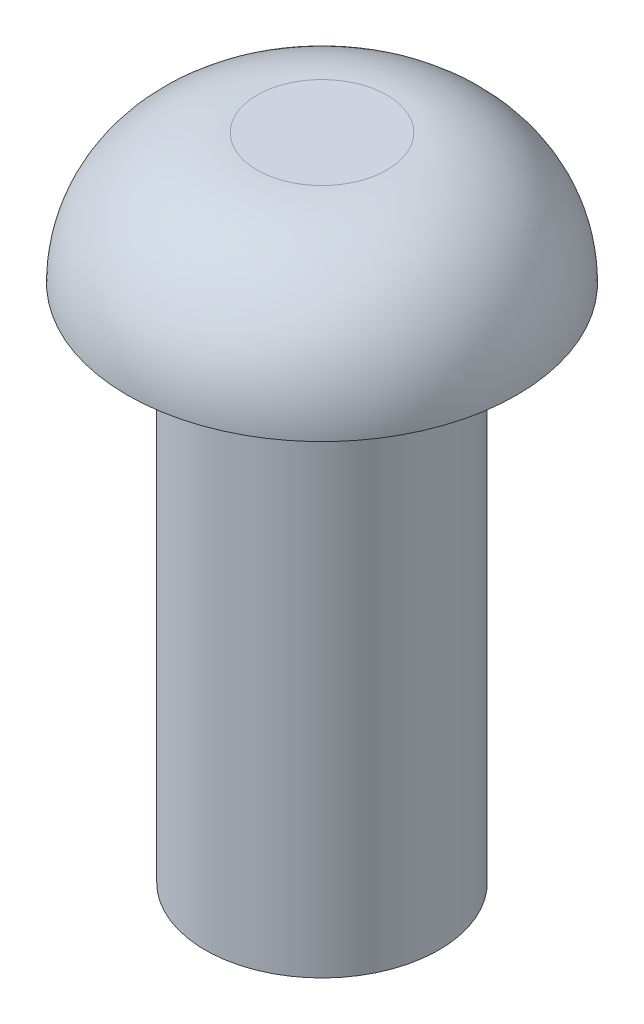
ISO-10303-21;
HEADER;
FILE_DESCRIPTION(('STEP AP214'),'2;1');
FILE_NAME('part.step','',(''),(''),'','','');
FILE_SCHEMA(('AUTOMOTIVE_DESIGN { 1 0 10303 214 1 1 1 1 }'));
ENDSEC;
DATA;
#1=APPLICATION_CONTEXT('core data for automotive mechanical design processes');
#2=APPLICATION_PROTOCOL_DEFINITION('international standard','automotive_design',2000,#1);
#3=PRODUCT_CONTEXT('',#1,'mechanical');
#4=PRODUCT('Part','Part','',(#3));
#5=PRODUCT_RELATED_PRODUCT_CATEGORY('part','',(#4));
#6=PRODUCT_DEFINITION_FORMATION('','',#4);
#7=PRODUCT_DEFINITION_CONTEXT('part definition',#1,'design');
#8=PRODUCT_DEFINITION('design','',#6,#7);
#9=PRODUCT_DEFINITION_SHAPE('','',#8);
#10=(LENGTH_UNIT() NAMED_UNIT(*) SI_UNIT(.MILLI.,.METRE.));
#11=(NAMED_UNIT(*) PLANE_ANGLE_UNIT() SI_UNIT($,.RADIAN.));
#12=(NAMED_UNIT(*) SI_UNIT($,.STERADIAN.) SOLID_ANGLE_UNIT());
#13=UNCERTAINTY_MEASURE_WITH_UNIT(LENGTH_MEASURE(1.E-05),#10,'distance_accuracy_value','');
#14=(GEOMETRIC_REPRESENTATION_CONTEXT(3) GLOBAL_UNCERTAINTY_ASSIGNED_CONTEXT((#13)) GLOBAL_UNIT_ASSIGNED_CONTEXT((#10,
#11,#12)) REPRESENTATION_CONTEXT('',''));
#15=CARTESIAN_POINT('',(0.,0.,0.));
#16=DIRECTION('',(0.,0.,1.));
#17=DIRECTION('',(1.,0.,0.));
#18=AXIS2_PLACEMENT_3D('',#15,#16,#17);
#19=CARTESIAN_POINT('',(0.,500.,0.));
#20=DIRECTION('',(0.,1.,0.));
#21=DIRECTION('',(0.,0.,1.));
#22=AXIS2_PLACEMENT_3D('',#19,#20,#21);
#23=PLANE('',#22);
#24=CARTESIAN_POINT('',(0.,500.,0.));
#25=DIRECTION('',(0.,1.,0.));
#26=DIRECTION('',(0.,0.,1.));
#27=AXIS2_PLACEMENT_3D('',#24,#25,#26);
#28=CIRCLE('',#27,50.);
#29=CARTESIAN_POINT('',(0.,500.,50.));
#30=VERTEX_POINT('',#29);
#31=EDGE_CURVE('E10',#30,#30,#28,.T.);
#32=ORIENTED_EDGE('',*,*,#31,.T.);
#33=EDGE_LOOP('',(#32));
#34=FACE_BOUND('',#33,.T.);
#35=ADVANCED_FACE('F35',(#34),#23,.T.);
#36=CARTESIAN_POINT('',(0.,400.,0.));
#37=DIRECTION('',(0.,-1.,0.));
#38=DIRECTION('',(0.,0.,-1.));
#39=AXIS2_PLACEMENT_3D('',#36,#37,#38);
#40=PLANE('',#39);
#41=CARTESIAN_POINT('',(0.,400.,0.));
#42=DIRECTION('',(0.,-1.,0.));
#43=DIRECTION('',(0.,0.,-1.));
#44=AXIS2_PLACEMENT_3D('',#41,#42,#43);
#45=CIRCLE('',#44,90.0000000000001);
#46=CARTESIAN_POINT('',(0.,400.,-90.0000000000001));
#47=VERTEX_POINT('',#46);
#48=EDGE_CURVE('E46',#47,#47,#45,.T.);
#49=ORIENTED_EDGE('',*,*,#48,.F.);
#50=EDGE_LOOP('',(#49));
#51=FACE_BOUND('',#50,.T.);
#52=CARTESIAN_POINT('',(0.,400.,0.));
#53=DIRECTION('',(0.,-1.,0.));
#54=DIRECTION('',(0.,0.,-1.));
#55=AXIS2_PLACEMENT_3D('',#52,#53,#54);
#56=CIRCLE('',#55,150.);
#57=CARTESIAN_POINT('',(0.,400.,-150.));
#58=VERTEX_POINT('',#57);
#59=EDGE_CURVE('E42',#58,#58,#56,.T.);
#60=ORIENTED_EDGE('',*,*,#59,.T.);
#61=EDGE_LOOP('',(#60));
#62=FACE_BOUND('',#61,.T.);
#63=ADVANCED_FACE('F60',(#51,#62),#40,.T.);
#64=CARTESIAN_POINT('',(0.,400.,0.));
#65=DIRECTION('',(0.,-1.,0.));
#66=DIRECTION('',(0.,0.,-1.));
#67=AXIS2_PLACEMENT_3D('',#64,#65,#66);
#68=CYLINDRICAL_SURFACE('',#67,90.0000000000001);
#69=ORIENTED_EDGE('',*,*,#48,.T.);
#70=EDGE_LOOP('',(#69));
#71=FACE_BOUND('',#70,.T.);
#72=CARTESIAN_POINT('',(0.,0.,0.));
#73=DIRECTION('',(0.,-1.,0.));
#74=DIRECTION('',(0.,0.,-1.));
#75=AXIS2_PLACEMENT_3D('',#72,#73,#74);
#76=CIRCLE('',#75,90.0000000000001);
#77=CARTESIAN_POINT('',(0.,0.,-90.0000000000001));
#78=VERTEX_POINT('',#77);
#79=EDGE_CURVE('E50',#78,#78,#76,.T.);
#80=ORIENTED_EDGE('',*,*,#79,.F.);
#81=EDGE_LOOP('',(#80));
#82=FACE_BOUND('',#81,.T.);
#83=ADVANCED_FACE('F58',(#71,#82),#68,.T.);
#84=CARTESIAN_POINT('',(0.,0.,0.));
#85=DIRECTION('',(0.,1.,0.));
#86=DIRECTION('',(0.,0.,1.));
#87=AXIS2_PLACEMENT_3D('',#84,#85,#86);
#88=PLANE('',#87);
#89=ORIENTED_EDGE('',*,*,#79,.T.);
#90=EDGE_LOOP('',(#89));
#91=FACE_BOUND('',#90,.T.);
#92=ADVANCED_FACE('F56',(#91),#88,.F.);
#93=CARTESIAN_POINT('',(0.,400.,0.));
#94=DIRECTION('',(0.,1.,0.));
#95=DIRECTION('',(0.,0.,1.));
#96=AXIS2_PLACEMENT_3D('',#93,#94,#95);
#97=DEGENERATE_TOROIDAL_SURFACE('',#96,50.,100.,.T.);
#98=ORIENTED_EDGE('',*,*,#59,.F.);
#99=EDGE_LOOP('',(#98));
#100=FACE_BOUND('',#99,.T.);
#101=ORIENTED_EDGE('',*,*,#31,.F.);
#102=EDGE_LOOP('',(#101));
#103=FACE_BOUND('',#102,.T.);
#104=ADVANCED_FACE('F37',(#100,#103),#97,.T.);
#105=CLOSED_SHELL('',(#35,#63,#83,#92,#104));
#106=MANIFOLD_SOLID_BREP('B2',#105);
#107=ADVANCED_BREP_SHAPE_REPRESENTATION('',(#18,#106),#14);
#108=SHAPE_DEFINITION_REPRESENTATION(#9,#107);
ENDSEC;
END-ISO-10303-21;
